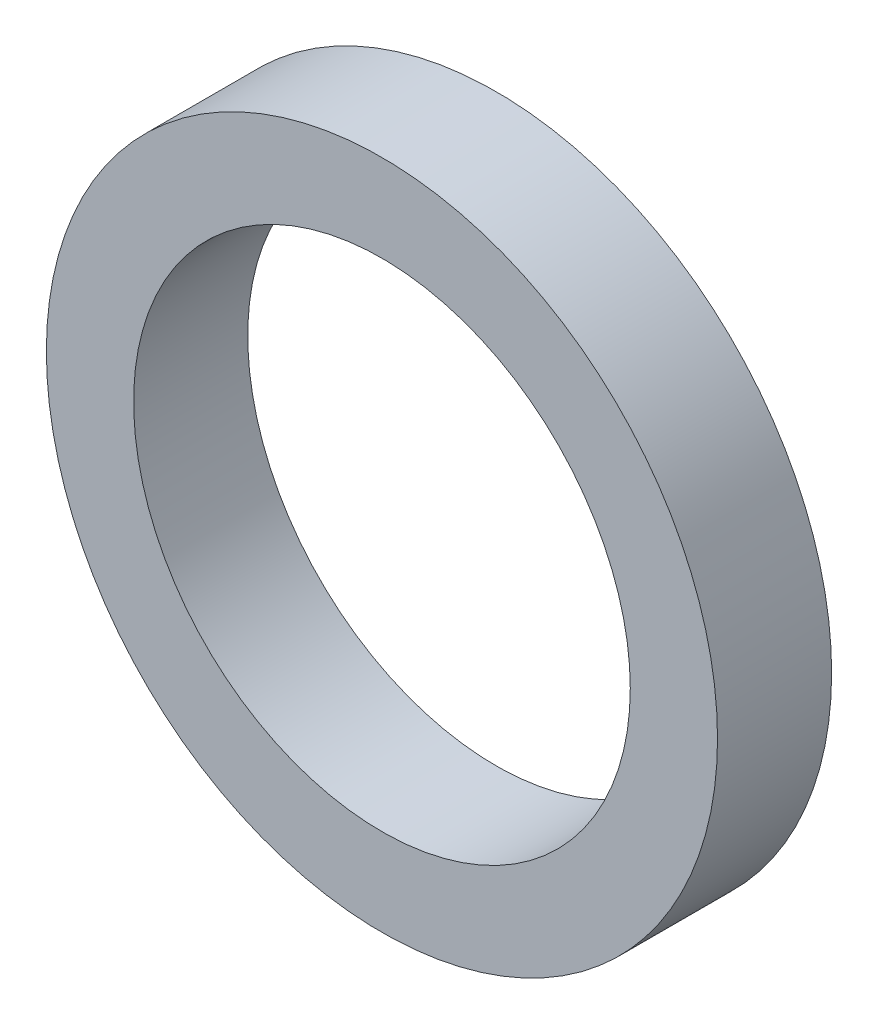
ISO-10303-21;
HEADER;
FILE_DESCRIPTION(('STEP AP214'),'2;1');
FILE_NAME('part.step','',(''),(''),'','','');
FILE_SCHEMA(('AUTOMOTIVE_DESIGN { 1 0 10303 214 1 1 1 1 }'));
ENDSEC;
DATA;
#1=APPLICATION_CONTEXT('core data for automotive mechanical design processes');
#2=APPLICATION_PROTOCOL_DEFINITION('international standard','automotive_design',2000,#1);
#3=PRODUCT_CONTEXT('',#1,'mechanical');
#4=PRODUCT('Part','Part','',(#3));
#5=PRODUCT_RELATED_PRODUCT_CATEGORY('part','',(#4));
#6=PRODUCT_DEFINITION_FORMATION('','',#4);
#7=PRODUCT_DEFINITION_CONTEXT('part definition',#1,'design');
#8=PRODUCT_DEFINITION('design','',#6,#7);
#9=PRODUCT_DEFINITION_SHAPE('','',#8);
#10=(LENGTH_UNIT() NAMED_UNIT(*) SI_UNIT(.MILLI.,.METRE.));
#11=(NAMED_UNIT(*) PLANE_ANGLE_UNIT() SI_UNIT($,.RADIAN.));
#12=(NAMED_UNIT(*) SI_UNIT($,.STERADIAN.) SOLID_ANGLE_UNIT());
#13=UNCERTAINTY_MEASURE_WITH_UNIT(LENGTH_MEASURE(1.E-05),#10,'distance_accuracy_value','');
#14=(GEOMETRIC_REPRESENTATION_CONTEXT(3) GLOBAL_UNCERTAINTY_ASSIGNED_CONTEXT((#13)) GLOBAL_UNIT_ASSIGNED_CONTEXT((#10,
#11,#12)) REPRESENTATION_CONTEXT('',''));
#15=CARTESIAN_POINT('',(0.,0.,0.));
#16=DIRECTION('',(0.,0.,1.));
#17=DIRECTION('',(1.,0.,0.));
#18=AXIS2_PLACEMENT_3D('',#15,#16,#17);
#19=CARTESIAN_POINT('',(0.,0.,2.55));
#20=DIRECTION('',(0.,0.,1.));
#21=DIRECTION('',(1.,0.,0.));
#22=AXIS2_PLACEMENT_3D('',#19,#20,#21);
#23=PLANE('',#22);
#24=CARTESIAN_POINT('',(0.,0.,2.55));
#25=DIRECTION('',(0.,0.,1.));
#26=DIRECTION('',(1.,0.,0.));
#27=AXIS2_PLACEMENT_3D('',#24,#25,#26);
#28=CIRCLE('',#27,7.5);
#29=CARTESIAN_POINT('',(7.5,0.,2.55));
#30=VERTEX_POINT('',#29);
#31=EDGE_CURVE('E10',#30,#30,#28,.T.);
#32=ORIENTED_EDGE('',*,*,#31,.T.);
#33=EDGE_LOOP('',(#32));
#34=FACE_BOUND('',#33,.T.);
#35=CARTESIAN_POINT('',(0.,0.,2.55));
#36=DIRECTION('',(0.,0.,1.));
#37=DIRECTION('',(1.,0.,0.));
#38=AXIS2_PLACEMENT_3D('',#35,#36,#37);
#39=CIRCLE('',#38,5.55);
#40=CARTESIAN_POINT('',(5.55,0.,2.55));
#41=VERTEX_POINT('',#40);
#42=EDGE_CURVE('E45',#41,#41,#39,.T.);
#43=ORIENTED_EDGE('',*,*,#42,.F.);
#44=EDGE_LOOP('',(#43));
#45=FACE_BOUND('',#44,.T.);
#46=ADVANCED_FACE('F34',(#34,#45),#23,.T.);
#47=CARTESIAN_POINT('',(0.,0.,0.));
#48=DIRECTION('',(0.,0.,1.));
#49=DIRECTION('',(1.,0.,0.));
#50=AXIS2_PLACEMENT_3D('',#47,#48,#49);
#51=PLANE('',#50);
#52=CARTESIAN_POINT('',(0.,0.,0.));
#53=DIRECTION('',(0.,0.,1.));
#54=DIRECTION('',(1.,0.,0.));
#55=AXIS2_PLACEMENT_3D('',#52,#53,#54);
#56=CIRCLE('',#55,7.5);
#57=CARTESIAN_POINT('',(7.5,0.,0.));
#58=VERTEX_POINT('',#57);
#59=EDGE_CURVE('E38',#58,#58,#56,.T.);
#60=ORIENTED_EDGE('',*,*,#59,.F.);
#61=EDGE_LOOP('',(#60));
#62=FACE_BOUND('',#61,.T.);
#63=CARTESIAN_POINT('',(0.,0.,0.));
#64=DIRECTION('',(0.,0.,1.));
#65=DIRECTION('',(1.,0.,0.));
#66=AXIS2_PLACEMENT_3D('',#63,#64,#65);
#67=CIRCLE('',#66,5.55);
#68=CARTESIAN_POINT('',(5.55,0.,0.));
#69=VERTEX_POINT('',#68);
#70=EDGE_CURVE('E47',#69,#69,#67,.T.);
#71=ORIENTED_EDGE('',*,*,#70,.T.);
#72=EDGE_LOOP('',(#71));
#73=FACE_BOUND('',#72,.T.);
#74=ADVANCED_FACE('F57',(#62,#73),#51,.F.);
#75=CARTESIAN_POINT('',(0.,0.,2.55));
#76=DIRECTION('',(0.,0.,-1.));
#77=DIRECTION('',(-1.,0.,0.));
#78=AXIS2_PLACEMENT_3D('',#75,#76,#77);
#79=CYLINDRICAL_SURFACE('',#78,7.5);
#80=ORIENTED_EDGE('',*,*,#31,.F.);
#81=EDGE_LOOP('',(#80));
#82=FACE_BOUND('',#81,.T.);
#83=ORIENTED_EDGE('',*,*,#59,.T.);
#84=EDGE_LOOP('',(#83));
#85=FACE_BOUND('',#84,.T.);
#86=ADVANCED_FACE('F36',(#82,#85),#79,.T.);
#87=CARTESIAN_POINT('',(0.,0.,2.55));
#88=DIRECTION('',(0.,0.,-1.));
#89=DIRECTION('',(-1.,0.,0.));
#90=AXIS2_PLACEMENT_3D('',#87,#88,#89);
#91=CYLINDRICAL_SURFACE('',#90,5.55);
#92=ORIENTED_EDGE('',*,*,#42,.T.);
#93=EDGE_LOOP('',(#92));
#94=FACE_BOUND('',#93,.T.);
#95=ORIENTED_EDGE('',*,*,#70,.F.);
#96=EDGE_LOOP('',(#95));
#97=FACE_BOUND('',#96,.T.);
#98=ADVANCED_FACE('F53',(#94,#97),#91,.F.);
#99=CLOSED_SHELL('',(#46,#74,#86,#98));
#100=MANIFOLD_SOLID_BREP('B2',#99);
#101=ADVANCED_BREP_SHAPE_REPRESENTATION('',(#18,#100),#14);
#102=SHAPE_DEFINITION_REPRESENTATION(#9,#101);
ENDSEC;
END-ISO-10303-21;
